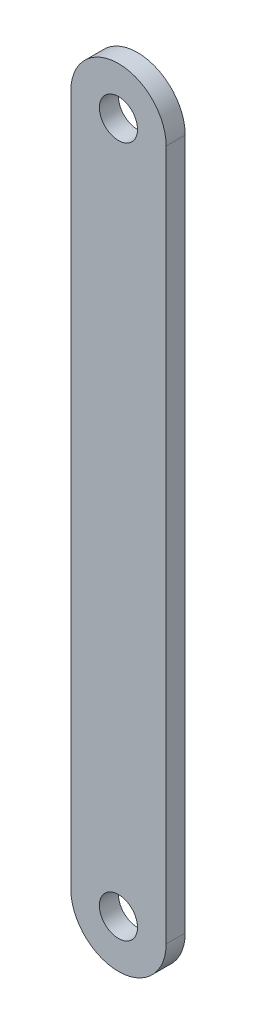
ISO-10303-21;
HEADER;
FILE_DESCRIPTION(('STEP AP214'),'2;1');
FILE_NAME('part.step','',(''),(''),'','','');
FILE_SCHEMA(('AUTOMOTIVE_DESIGN { 1 0 10303 214 1 1 1 1 }'));
ENDSEC;
DATA;
#1=APPLICATION_CONTEXT('core data for automotive mechanical design processes');
#2=APPLICATION_PROTOCOL_DEFINITION('international standard','automotive_design',2000,#1);
#3=PRODUCT_CONTEXT('',#1,'mechanical');
#4=PRODUCT('Part','Part','',(#3));
#5=PRODUCT_RELATED_PRODUCT_CATEGORY('part','',(#4));
#6=PRODUCT_DEFINITION_FORMATION('','',#4);
#7=PRODUCT_DEFINITION_CONTEXT('part definition',#1,'design');
#8=PRODUCT_DEFINITION('design','',#6,#7);
#9=PRODUCT_DEFINITION_SHAPE('','',#8);
#10=(LENGTH_UNIT() NAMED_UNIT(*) SI_UNIT(.MILLI.,.METRE.));
#11=(NAMED_UNIT(*) PLANE_ANGLE_UNIT() SI_UNIT($,.RADIAN.));
#12=(NAMED_UNIT(*) SI_UNIT($,.STERADIAN.) SOLID_ANGLE_UNIT());
#13=UNCERTAINTY_MEASURE_WITH_UNIT(LENGTH_MEASURE(1.E-05),#10,'distance_accuracy_value','');
#14=(GEOMETRIC_REPRESENTATION_CONTEXT(3) GLOBAL_UNCERTAINTY_ASSIGNED_CONTEXT((#13)) GLOBAL_UNIT_ASSIGNED_CONTEXT((#10,
#11,#12)) REPRESENTATION_CONTEXT('',''));
#15=CARTESIAN_POINT('',(0.,0.,0.));
#16=DIRECTION('',(0.,0.,1.));
#17=DIRECTION('',(1.,0.,0.));
#18=AXIS2_PLACEMENT_3D('',#15,#16,#17);
#19=CARTESIAN_POINT('',(5.,-72.5,2.));
#20=DIRECTION('',(-1.,0.,0.));
#21=DIRECTION('',(0.,-1.,0.));
#22=AXIS2_PLACEMENT_3D('',#19,#20,#21);
#23=PLANE('',#22);
#24=DIRECTION('',(0.,0.,1.));
#25=VECTOR('',#24,1.);
#26=CARTESIAN_POINT('',(5.,0.,0.));
#27=LINE('',#26,#25);
#28=CARTESIAN_POINT('',(5.,0.,0.));
#29=VERTEX_POINT('',#28);
#30=CARTESIAN_POINT('',(5.,0.,2.));
#31=VERTEX_POINT('',#30);
#32=EDGE_CURVE('E93',#29,#31,#27,.T.);
#33=ORIENTED_EDGE('',*,*,#32,.T.);
#34=DIRECTION('',(0.,1.,0.));
#35=VECTOR('',#34,1.);
#36=CARTESIAN_POINT('',(5.,-72.5,2.));
#37=LINE('',#36,#35);
#38=CARTESIAN_POINT('',(5.,-72.5,2.));
#39=VERTEX_POINT('',#38);
#40=EDGE_CURVE('E81',#39,#31,#37,.T.);
#41=ORIENTED_EDGE('',*,*,#40,.F.);
#42=DIRECTION('',(0.,0.,-1.));
#43=VECTOR('',#42,1.);
#44=CARTESIAN_POINT('',(5.,-72.5,2.));
#45=LINE('',#44,#43);
#46=CARTESIAN_POINT('',(5.,-72.5,0.));
#47=VERTEX_POINT('',#46);
#48=EDGE_CURVE('E11',#39,#47,#45,.T.);
#49=ORIENTED_EDGE('',*,*,#48,.T.);
#50=DIRECTION('',(0.,1.,0.));
#51=VECTOR('',#50,1.);
#52=CARTESIAN_POINT('',(5.,-72.5,0.));
#53=LINE('',#52,#51);
#54=EDGE_CURVE('E64',#47,#29,#53,.T.);
#55=ORIENTED_EDGE('',*,*,#54,.T.);
#56=EDGE_LOOP('',(#33,#41,#49,#55));
#57=FACE_BOUND('',#56,.T.);
#58=ADVANCED_FACE('F19',(#57),#23,.F.);
#59=CARTESIAN_POINT('',(0.,-72.5,2.));
#60=DIRECTION('',(0.,0.,1.));
#61=DIRECTION('',(1.,0.,0.));
#62=AXIS2_PLACEMENT_3D('',#59,#60,#61);
#63=PLANE('',#62);
#64=CARTESIAN_POINT('',(0.,0.,2.));
#65=DIRECTION('',(0.,0.,-1.));
#66=DIRECTION('',(-1.,0.,0.));
#67=AXIS2_PLACEMENT_3D('',#64,#65,#66);
#68=CIRCLE('',#67,5.);
#69=CARTESIAN_POINT('',(-5.,0.,2.));
#70=VERTEX_POINT('',#69);
#71=EDGE_CURVE('E97',#70,#31,#68,.T.);
#72=ORIENTED_EDGE('',*,*,#71,.F.);
#73=DIRECTION('',(0.,-1.,0.));
#74=VECTOR('',#73,1.);
#75=CARTESIAN_POINT('',(-5.,-72.5,2.));
#76=LINE('',#75,#74);
#77=CARTESIAN_POINT('',(-5.,-72.5,2.));
#78=VERTEX_POINT('',#77);
#79=EDGE_CURVE('E43',#70,#78,#76,.T.);
#80=ORIENTED_EDGE('',*,*,#79,.T.);
#81=CARTESIAN_POINT('',(0.,-72.5,2.));
#82=DIRECTION('',(0.,0.,1.));
#83=DIRECTION('',(1.,0.,0.));
#84=AXIS2_PLACEMENT_3D('',#81,#82,#83);
#85=CIRCLE('',#84,5.);
#86=EDGE_CURVE('E63',#78,#39,#85,.T.);
#87=ORIENTED_EDGE('',*,*,#86,.T.);
#88=ORIENTED_EDGE('',*,*,#40,.T.);
#89=EDGE_LOOP('',(#72,#80,#87,#88));
#90=FACE_BOUND('',#89,.T.);
#91=CARTESIAN_POINT('',(0.,-72.5,2.));
#92=DIRECTION('',(0.,0.,1.));
#93=DIRECTION('',(1.,0.,0.));
#94=AXIS2_PLACEMENT_3D('',#91,#92,#93);
#95=CIRCLE('',#94,2.);
#96=CARTESIAN_POINT('',(2.,-72.5,2.));
#97=VERTEX_POINT('',#96);
#98=EDGE_CURVE('E73',#97,#97,#95,.T.);
#99=ORIENTED_EDGE('',*,*,#98,.F.);
#100=EDGE_LOOP('',(#99));
#101=FACE_BOUND('',#100,.T.);
#102=CARTESIAN_POINT('',(0.,0.,2.));
#103=DIRECTION('',(0.,0.,1.));
#104=DIRECTION('',(1.,0.,0.));
#105=AXIS2_PLACEMENT_3D('',#102,#103,#104);
#106=CIRCLE('',#105,2.);
#107=CARTESIAN_POINT('',(1.99999999999998,0.,2.));
#108=VERTEX_POINT('',#107);
#109=EDGE_CURVE('E86',#108,#108,#106,.T.);
#110=ORIENTED_EDGE('',*,*,#109,.F.);
#111=EDGE_LOOP('',(#110));
#112=FACE_BOUND('',#111,.T.);
#113=ADVANCED_FACE('F104',(#90,#101,#112),#63,.T.);
#114=CARTESIAN_POINT('',(0.,-72.5,0.));
#115=DIRECTION('',(0.,0.,1.));
#116=DIRECTION('',(1.,0.,0.));
#117=AXIS2_PLACEMENT_3D('',#114,#115,#116);
#118=PLANE('',#117);
#119=CARTESIAN_POINT('',(0.,-72.5,0.));
#120=DIRECTION('',(0.,0.,1.));
#121=DIRECTION('',(1.,0.,0.));
#122=AXIS2_PLACEMENT_3D('',#119,#120,#121);
#123=CIRCLE('',#122,2.);
#124=CARTESIAN_POINT('',(2.,-72.5,0.));
#125=VERTEX_POINT('',#124);
#126=EDGE_CURVE('E77',#125,#125,#123,.T.);
#127=ORIENTED_EDGE('',*,*,#126,.T.);
#128=EDGE_LOOP('',(#127));
#129=FACE_BOUND('',#128,.T.);
#130=DIRECTION('',(0.,-1.,0.));
#131=VECTOR('',#130,1.);
#132=CARTESIAN_POINT('',(-5.,-72.5,0.));
#133=LINE('',#132,#131);
#134=CARTESIAN_POINT('',(-5.,0.,0.));
#135=VERTEX_POINT('',#134);
#136=CARTESIAN_POINT('',(-5.,-72.5,0.));
#137=VERTEX_POINT('',#136);
#138=EDGE_CURVE('E56',#135,#137,#133,.T.);
#139=ORIENTED_EDGE('',*,*,#138,.F.);
#140=CARTESIAN_POINT('',(0.,0.,0.));
#141=DIRECTION('',(0.,0.,-1.));
#142=DIRECTION('',(-1.,0.,0.));
#143=AXIS2_PLACEMENT_3D('',#140,#141,#142);
#144=CIRCLE('',#143,5.);
#145=EDGE_CURVE('E34',#135,#29,#144,.T.);
#146=ORIENTED_EDGE('',*,*,#145,.T.);
#147=ORIENTED_EDGE('',*,*,#54,.F.);
#148=CARTESIAN_POINT('',(0.,-72.5,0.));
#149=DIRECTION('',(0.,0.,1.));
#150=DIRECTION('',(1.,0.,0.));
#151=AXIS2_PLACEMENT_3D('',#148,#149,#150);
#152=CIRCLE('',#151,5.);
#153=EDGE_CURVE('E69',#137,#47,#152,.T.);
#154=ORIENTED_EDGE('',*,*,#153,.F.);
#155=EDGE_LOOP('',(#139,#146,#147,#154));
#156=FACE_BOUND('',#155,.T.);
#157=CARTESIAN_POINT('',(0.,0.,0.));
#158=DIRECTION('',(0.,0.,1.));
#159=DIRECTION('',(1.,0.,0.));
#160=AXIS2_PLACEMENT_3D('',#157,#158,#159);
#161=CIRCLE('',#160,2.);
#162=CARTESIAN_POINT('',(1.99999999999998,0.,0.));
#163=VERTEX_POINT('',#162);
#164=EDGE_CURVE('E88',#163,#163,#161,.T.);
#165=ORIENTED_EDGE('',*,*,#164,.T.);
#166=EDGE_LOOP('',(#165));
#167=FACE_BOUND('',#166,.T.);
#168=ADVANCED_FACE('F70',(#129,#156,#167),#118,.F.);
#169=CARTESIAN_POINT('',(0.,-72.5,2.));
#170=DIRECTION('',(0.,0.,-1.));
#171=DIRECTION('',(-1.,0.,0.));
#172=AXIS2_PLACEMENT_3D('',#169,#170,#171);
#173=CYLINDRICAL_SURFACE('',#172,5.);
#174=ORIENTED_EDGE('',*,*,#153,.T.);
#175=ORIENTED_EDGE('',*,*,#48,.F.);
#176=ORIENTED_EDGE('',*,*,#86,.F.);
#177=DIRECTION('',(0.,0.,-1.));
#178=VECTOR('',#177,1.);
#179=CARTESIAN_POINT('',(-5.,-72.5,2.));
#180=LINE('',#179,#178);
#181=EDGE_CURVE('E27',#78,#137,#180,.T.);
#182=ORIENTED_EDGE('',*,*,#181,.T.);
#183=EDGE_LOOP('',(#174,#175,#176,#182));
#184=FACE_BOUND('',#183,.T.);
#185=ADVANCED_FACE('F21',(#184),#173,.T.);
#186=CARTESIAN_POINT('',(-5.,-72.5,2.));
#187=DIRECTION('',(1.,0.,0.));
#188=DIRECTION('',(0.,1.,0.));
#189=AXIS2_PLACEMENT_3D('',#186,#187,#188);
#190=PLANE('',#189);
#191=ORIENTED_EDGE('',*,*,#79,.F.);
#192=DIRECTION('',(0.,0.,1.));
#193=VECTOR('',#192,1.);
#194=CARTESIAN_POINT('',(-5.,0.,0.));
#195=LINE('',#194,#193);
#196=EDGE_CURVE('E60',#135,#70,#195,.T.);
#197=ORIENTED_EDGE('',*,*,#196,.F.);
#198=ORIENTED_EDGE('',*,*,#138,.T.);
#199=ORIENTED_EDGE('',*,*,#181,.F.);
#200=EDGE_LOOP('',(#191,#197,#198,#199));
#201=FACE_BOUND('',#200,.T.);
#202=ADVANCED_FACE('F58',(#201),#190,.F.);
#203=CARTESIAN_POINT('',(0.,-72.5,2.));
#204=DIRECTION('',(0.,0.,-1.));
#205=DIRECTION('',(-1.,0.,0.));
#206=AXIS2_PLACEMENT_3D('',#203,#204,#205);
#207=CYLINDRICAL_SURFACE('',#206,2.);
#208=ORIENTED_EDGE('',*,*,#98,.T.);
#209=EDGE_LOOP('',(#208));
#210=FACE_BOUND('',#209,.T.);
#211=ORIENTED_EDGE('',*,*,#126,.F.);
#212=EDGE_LOOP('',(#211));
#213=FACE_BOUND('',#212,.T.);
#214=ADVANCED_FACE('F116',(#210,#213),#207,.F.);
#215=CARTESIAN_POINT('',(0.,0.,2.));
#216=DIRECTION('',(0.,0.,-1.));
#217=DIRECTION('',(-1.,0.,0.));
#218=AXIS2_PLACEMENT_3D('',#215,#216,#217);
#219=CYLINDRICAL_SURFACE('',#218,2.);
#220=ORIENTED_EDGE('',*,*,#109,.T.);
#221=EDGE_LOOP('',(#220));
#222=FACE_BOUND('',#221,.T.);
#223=ORIENTED_EDGE('',*,*,#164,.F.);
#224=EDGE_LOOP('',(#223));
#225=FACE_BOUND('',#224,.T.);
#226=ADVANCED_FACE('F112',(#222,#225),#219,.F.);
#227=CARTESIAN_POINT('',(0.,0.,0.));
#228=DIRECTION('',(0.,0.,1.));
#229=DIRECTION('',(1.,0.,0.));
#230=AXIS2_PLACEMENT_3D('',#227,#228,#229);
#231=CYLINDRICAL_SURFACE('',#230,5.);
#232=ORIENTED_EDGE('',*,*,#71,.T.);
#233=ORIENTED_EDGE('',*,*,#32,.F.);
#234=ORIENTED_EDGE('',*,*,#145,.F.);
#235=ORIENTED_EDGE('',*,*,#196,.T.);
#236=EDGE_LOOP('',(#232,#233,#234,#235));
#237=FACE_BOUND('',#236,.T.);
#238=ADVANCED_FACE('F115',(#237),#231,.T.);
#239=CLOSED_SHELL('',(#58,#113,#168,#185,#202,#214,#226,#238));
#240=MANIFOLD_SOLID_BREP('B1',#239);
#241=ADVANCED_BREP_SHAPE_REPRESENTATION('',(#18,#240),#14);
#242=SHAPE_DEFINITION_REPRESENTATION(#9,#241);
ENDSEC;
END-ISO-10303-21;
